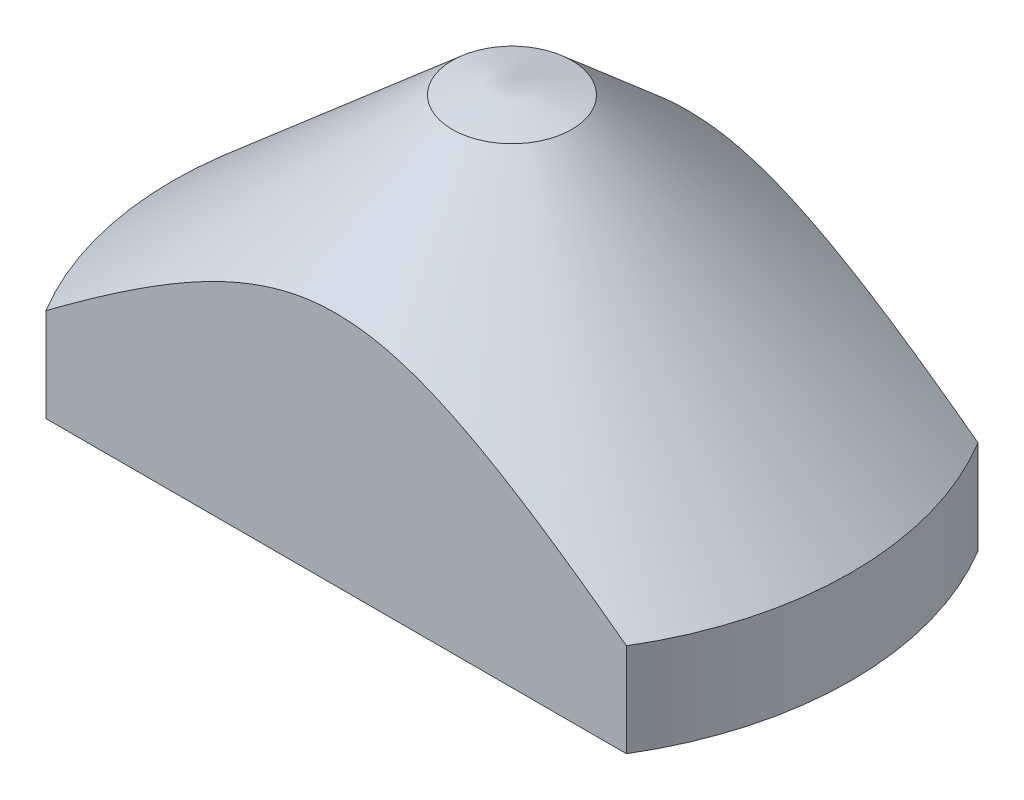
ISO-10303-21;
HEADER;
FILE_DESCRIPTION(('STEP AP214'),'2;1');
FILE_NAME('part.step','',(''),(''),'','','');
FILE_SCHEMA(('AUTOMOTIVE_DESIGN { 1 0 10303 214 1 1 1 1 }'));
ENDSEC;
DATA;
#1=APPLICATION_CONTEXT('core data for automotive mechanical design processes');
#2=APPLICATION_PROTOCOL_DEFINITION('international standard','automotive_design',2000,#1);
#3=PRODUCT_CONTEXT('',#1,'mechanical');
#4=PRODUCT('Part','Part','',(#3));
#5=PRODUCT_RELATED_PRODUCT_CATEGORY('part','',(#4));
#6=PRODUCT_DEFINITION_FORMATION('','',#4);
#7=PRODUCT_DEFINITION_CONTEXT('part definition',#1,'design');
#8=PRODUCT_DEFINITION('design','',#6,#7);
#9=PRODUCT_DEFINITION_SHAPE('','',#8);
#10=(LENGTH_UNIT() NAMED_UNIT(*) SI_UNIT(.MILLI.,.METRE.));
#11=(NAMED_UNIT(*) PLANE_ANGLE_UNIT() SI_UNIT($,.RADIAN.));
#12=(NAMED_UNIT(*) SI_UNIT($,.STERADIAN.) SOLID_ANGLE_UNIT());
#13=UNCERTAINTY_MEASURE_WITH_UNIT(LENGTH_MEASURE(1.E-05),#10,'distance_accuracy_value','');
#14=(GEOMETRIC_REPRESENTATION_CONTEXT(3) GLOBAL_UNCERTAINTY_ASSIGNED_CONTEXT((#13)) GLOBAL_UNIT_ASSIGNED_CONTEXT((#10,
#11,#12)) REPRESENTATION_CONTEXT('',''));
#15=CARTESIAN_POINT('',(0.,0.,0.));
#16=DIRECTION('',(0.,0.,1.));
#17=DIRECTION('',(1.,0.,0.));
#18=AXIS2_PLACEMENT_3D('',#15,#16,#17);
#19=CARTESIAN_POINT('',(0.,48.,0.));
#20=DIRECTION('',(0.,-1.,0.));
#21=DIRECTION('',(0.,0.,-1.));
#22=AXIS2_PLACEMENT_3D('',#19,#20,#21);
#23=CONICAL_SURFACE('',#22,8.5,0.853125178499766);
#24=CARTESIAN_POINT('',(130.802393695168,-60.8314780742673,25.));
#25=CARTESIAN_POINT('',(129.280659289647,-59.5266924388184,25.));
#26=CARTESIAN_POINT('',(127.758531853387,-58.2223651531503,25.));
#27=CARTESIAN_POINT('',(124.71338920465,-55.614733063404,25.));
#28=CARTESIAN_POINT('',(123.190373988095,-54.3114282640888,25.));
#29=CARTESIAN_POINT('',(118.613881665169,-50.398107886476,25.));
#30=CARTESIAN_POINT('',(115.558933791566,-47.7898118000967,25.));
#31=CARTESIAN_POINT('',(109.349576632576,-42.4983824116583,25.));
#32=CARTESIAN_POINT('',(106.19501348337,-39.8154295788899,25.));
#33=CARTESIAN_POINT('',(101.461230348434,-35.7995715022813,25.));
#34=CARTESIAN_POINT('',(99.8845333189138,-34.4636921002713,25.));
#35=CARTESIAN_POINT('',(96.7292952726487,-31.794271580091,25.));
#36=CARTESIAN_POINT('',(95.1507543514824,-30.4607303489665,25.));
#37=CARTESIAN_POINT('',(91.8960836495198,-27.7158272957364,25.));
#38=CARTESIAN_POINT('',(90.2198164157939,-26.3046284219135,25.));
#39=CARTESIAN_POINT('',(86.8643756827855,-23.4856876048941,25.));
#40=CARTESIAN_POINT('',(85.1852021820712,-22.0779456634016,25.));
#41=CARTESIAN_POINT('',(81.8229795155766,-19.2661804166402,25.));
#42=CARTESIAN_POINT('',(80.1399294324073,-17.862158208047,25.));
#43=CARTESIAN_POINT('',(76.7697527626938,-15.0590174648288,25.));
#44=CARTESIAN_POINT('',(75.0826261812961,-13.6598989240185,25.));
#45=CARTESIAN_POINT('',(71.6888803417423,-10.8555373311975,25.));
#46=CARTESIAN_POINT('',(69.9822185611411,-9.45034571536391,25.));
#47=CARTESIAN_POINT('',(66.5628098973319,-6.64736190927108,25.));
#48=CARTESIAN_POINT('',(64.8500629813383,-5.24956975898008,25.));
#49=CARTESIAN_POINT('',(61.4188870997408,-2.46469583555102,25.));
#50=CARTESIAN_POINT('',(59.7004660726097,-1.07760428741374,25.));
#51=CARTESIAN_POINT('',(56.2542896469761,1.68489165119693,25.));
#52=CARTESIAN_POINT('',(54.5265344158168,3.06029625006322,25.));
#53=CARTESIAN_POINT('',(51.9542690685346,5.08970535323588,25.));
#54=CARTESIAN_POINT('',(51.1143321073181,5.74950796001547,25.));
#55=CARTESIAN_POINT('',(49.4312847954013,7.06505187064022,25.));
#56=CARTESIAN_POINT('',(48.5881744517191,7.7207931834588,25.));
#57=CARTESIAN_POINT('',(46.8982848827432,9.02766501876879,25.));
#58=CARTESIAN_POINT('',(46.0515053866895,9.67879519131541,25.));
#59=CARTESIAN_POINT('',(44.3538261782609,10.9756653603516,25.));
#60=CARTESIAN_POINT('',(43.5029264658828,11.6214053568371,25.));
#61=CARTESIAN_POINT('',(41.792812963855,12.9093081692026,25.));
#62=CARTESIAN_POINT('',(40.933579264862,13.5514445693787,25.));
#63=CARTESIAN_POINT('',(39.2096011852629,14.8282869337091,25.));
#64=CARTESIAN_POINT('',(38.344856795653,15.4629928857181,25.));
#65=CARTESIAN_POINT('',(36.6091633395537,16.7234644882544,25.));
#66=CARTESIAN_POINT('',(35.7382156979612,17.3492320986083,25.));
#67=CARTESIAN_POINT('',(33.9888551310585,18.5902552505681,25.));
#68=CARTESIAN_POINT('',(33.1104422252741,19.2055108196563,25.));
#69=CARTESIAN_POINT('',(31.3602920175456,20.4126841284651,25.));
#70=CARTESIAN_POINT('',(30.4887067112072,21.0048218435013,25.));
#71=CARTESIAN_POINT('',(28.7355689280005,22.1742185920558,25.));
#72=CARTESIAN_POINT('',(27.8540162985064,22.751477397294,25.));
#73=CARTESIAN_POINT('',(26.0781662497645,23.8883351174885,25.));
#74=CARTESIAN_POINT('',(25.1838556337671,24.4479134792536,25.));
#75=CARTESIAN_POINT('',(23.3813416021952,25.5442483555153,25.));
#76=CARTESIAN_POINT('',(22.4731386884714,26.0810056917723,25.));
#77=CARTESIAN_POINT('',(20.6469381969784,27.122060677512,25.));
#78=CARTESIAN_POINT('',(19.7290590995281,27.6265651577746,25.));
#79=CARTESIAN_POINT('',(17.8741714937969,28.5998209471632,25.));
#80=CARTESIAN_POINT('',(16.9371594080412,29.068565490862,25.));
#81=CARTESIAN_POINT('',(15.0434878389258,29.9592537468159,25.));
#82=CARTESIAN_POINT('',(14.0868753443891,30.3812966994844,25.));
#83=CARTESIAN_POINT('',(12.1500960255103,31.1668584878009,25.));
#84=CARTESIAN_POINT('',(11.1699439776242,31.530412988968,25.));
#85=CARTESIAN_POINT('',(9.94458926380311,31.9337444445563,25.));
#86=CARTESIAN_POINT('',(9.71071938458372,32.0084623261258,25.));
#87=CARTESIAN_POINT('',(9.24158302584031,32.1536180824024,25.));
#88=CARTESIAN_POINT('',(9.00631620571419,32.2240548619432,25.));
#89=CARTESIAN_POINT('',(8.53435755084274,32.3604413379082,25.));
#90=CARTESIAN_POINT('',(8.29766505983997,32.4263887633444,25.));
#91=CARTESIAN_POINT('',(7.82302120255998,32.5535335916309,25.));
#92=CARTESIAN_POINT('',(7.58506991091217,32.6147312727775,25.));
#93=CARTESIAN_POINT('',(7.10807319575468,32.7321296546942,25.));
#94=CARTESIAN_POINT('',(6.86902844274142,32.7883330734463,25.));
#95=CARTESIAN_POINT('',(6.38978272677502,32.8955666965711,25.));
#96=CARTESIAN_POINT('',(6.14958175034788,32.9465968405037,25.));
#97=CARTESIAN_POINT('',(5.42739128833393,33.0916051725528,25.));
#98=CARTESIAN_POINT('',(4.94374838673838,33.177517582979,25.));
#99=CARTESIAN_POINT('',(3.98666897127328,33.3241994186456,25.));
#100=CARTESIAN_POINT('',(3.5133308452728,33.3856114467715,25.));
#101=CARTESIAN_POINT('',(2.56423960231385,33.4855811186059,25.));
#102=CARTESIAN_POINT('',(2.08848654125442,33.5241392889068,25.));
#103=CARTESIAN_POINT('',(1.13531176807347,33.5776824099422,25.));
#104=CARTESIAN_POINT('',(0.657889113654298,33.5926506664514,25.));
#105=CARTESIAN_POINT('',(-0.297107160996715,33.5986659074522,25.));
#106=CARTESIAN_POINT('',(-0.774680781053067,33.5897129196488,25.));
#107=CARTESIAN_POINT('',(-1.73310803348344,33.5478743148623,25.));
#108=CARTESIAN_POINT('',(-2.21395219258037,33.5147726508169,25.));
#109=CARTESIAN_POINT('',(-3.17342785364992,33.4250457533554,25.));
#110=CARTESIAN_POINT('',(-3.65205935486748,33.3684205119125,25.));
#111=CARTESIAN_POINT('',(-4.60598472863177,33.2327227650587,25.));
#112=CARTESIAN_POINT('',(-5.08127944176322,33.1536561372999,25.));
#113=CARTESIAN_POINT('',(-6.02785990681186,32.9744331346898,25.));
#114=CARTESIAN_POINT('',(-6.49914562155246,32.8742765644869,25.));
#115=CARTESIAN_POINT('',(-7.4428369918218,32.6530943773904,25.));
#116=CARTESIAN_POINT('',(-7.91518627301193,32.5318292582273,25.));
#117=CARTESIAN_POINT('',(-8.85478767711132,32.2710049145639,25.));
#118=CARTESIAN_POINT('',(-9.32203976332258,32.1314455584455,25.));
#119=CARTESIAN_POINT('',(-10.2512467008444,31.8357558885278,25.));
#120=CARTESIAN_POINT('',(-10.7132016214739,31.6796257918489,25.));
#121=CARTESIAN_POINT('',(-11.631761690925,31.3524573037518,25.));
#122=CARTESIAN_POINT('',(-12.0883669806044,31.18141930587,25.));
#123=CARTESIAN_POINT('',(-13.3565772922238,30.6849815427685,25.));
#124=CARTESIAN_POINT('',(-14.1624064029701,30.3447790317837,25.));
#125=CARTESIAN_POINT('',(-15.7584510552981,29.6293405451154,25.));
#126=CARTESIAN_POINT('',(-16.548662260404,29.2540950004499,25.));
#127=CARTESIAN_POINT('',(-18.1156717302813,28.4747226738099,25.));
#128=CARTESIAN_POINT('',(-18.8924551901079,28.0705662597317,25.));
#129=CARTESIAN_POINT('',(-20.4333285568865,27.2389990313797,25.));
#130=CARTESIAN_POINT('',(-21.1974195256321,26.8115901752139,25.));
#131=CARTESIAN_POINT('',(-22.7174524940606,25.9359763730643,25.));
#132=CARTESIAN_POINT('',(-23.4733521014959,25.487698081064,25.));
#133=CARTESIAN_POINT('',(-24.9754617510028,24.5752071185761,25.));
#134=CARTESIAN_POINT('',(-25.7216716293565,24.1109941793376,25.));
#135=CARTESIAN_POINT('',(-27.2052614146596,23.1695478311066,25.));
#136=CARTESIAN_POINT('',(-27.9426457726717,22.6923214210774,25.));
#137=CARTESIAN_POINT('',(-29.4100714295861,21.7267403159826,25.));
#138=CARTESIAN_POINT('',(-30.1401127808126,21.2383857002947,25.));
#139=CARTESIAN_POINT('',(-31.6043472726171,20.2450972248594,25.));
#140=CARTESIAN_POINT('',(-32.3384468285677,19.7400256010026,25.));
#141=CARTESIAN_POINT('',(-33.8008953414286,18.7216325978598,25.));
#142=CARTESIAN_POINT('',(-34.5292442916375,18.2083112089621,25.));
#143=CARTESIAN_POINT('',(-35.9809721390196,17.1745498544624,25.));
#144=CARTESIAN_POINT('',(-36.7043505573261,16.6541092170383,25.));
#145=CARTESIAN_POINT('',(-38.1466783457339,15.6071251861495,25.));
#146=CARTESIAN_POINT('',(-38.8656276974465,15.0805817673732,25.));
#147=CARTESIAN_POINT('',(-40.2978351927086,14.0235107971159,25.));
#148=CARTESIAN_POINT('',(-41.0111030308727,13.4929963717056,25.));
#149=CARTESIAN_POINT('',(-42.4341880176938,12.4273623717724,25.));
#150=CARTESIAN_POINT('',(-43.1440051672265,11.8922427984181,25.));
#151=CARTESIAN_POINT('',(-44.5605405278599,10.8179803834008,25.));
#152=CARTESIAN_POINT('',(-45.2672588665411,10.2788377098883,25.));
#153=CARTESIAN_POINT('',(-46.6779546015786,9.19697959470088,25.));
#154=CARTESIAN_POINT('',(-47.3819319970823,8.65426415191481,25.));
#155=CARTESIAN_POINT('',(-49.0003229372636,7.40077760847231,25.));
#156=CARTESIAN_POINT('',(-49.9138807552096,6.68890170177854,25.));
#157=CARTESIAN_POINT('',(-51.7373678987467,5.26051604110707,25.));
#158=CARTESIAN_POINT('',(-52.6472972138454,4.54400627374556,25.));
#159=CARTESIAN_POINT('',(-55.3723540352935,2.38846157644234,25.));
#160=CARTESIAN_POINT('',(-57.1827343414347,0.943423739157828,25.));
#161=CARTESIAN_POINT('',(-60.7937562984219,-1.95895720196784,25.));
#162=CARTESIAN_POINT('',(-62.5943973879373,-3.41630100293557,25.));
#163=CARTESIAN_POINT('',(-66.1878618909792,-6.34057070421115,25.));
#164=CARTESIAN_POINT('',(-67.980685344468,-7.80749655544121,25.));
#165=CARTESIAN_POINT('',(-71.5621439896917,-10.7507171945538,25.));
#166=CARTESIAN_POINT('',(-73.3507718062916,-12.2270209506392,25.));
#167=CARTESIAN_POINT('',(-76.9228848284013,-15.1858381313815,25.));
#168=CARTESIAN_POINT('',(-78.7063700283911,-16.6683515626996,25.));
#169=CARTESIAN_POINT('',(-82.2690363003365,-19.638429955258,25.));
#170=CARTESIAN_POINT('',(-84.0482175008165,-21.1259947623861,25.));
#171=CARTESIAN_POINT('',(-87.6030237868425,-24.1053644075509,25.));
#172=CARTESIAN_POINT('',(-89.3786488738602,-25.5971692438322,25.));
#173=CARTESIAN_POINT('',(-94.4741227816312,-29.8868593773345,25.));
#174=CARTESIAN_POINT('',(-97.7902349822544,-32.6891831243756,25.));
#175=CARTESIAN_POINT('',(-104.414724930364,-38.3030113631827,25.));
#176=CARTESIAN_POINT('',(-107.723102606927,-41.1145159385721,25.));
#177=CARTESIAN_POINT('',(-114.329271228769,-46.7405533813673,25.));
#178=CARTESIAN_POINT('',(-117.627070516235,-49.555076455453,25.));
#179=CARTESIAN_POINT('',(-122.570270507038,-53.7809115070905,25.));
#180=CARTESIAN_POINT('',(-124.21741070298,-55.1901897062918,25.));
#181=CARTESIAN_POINT('',(-127.510651595871,-58.0099593899194,25.));
#182=CARTESIAN_POINT('',(-129.156752293068,-59.4204508740572,25.));
#183=CARTESIAN_POINT('',(-130.802393695168,-60.8314780742673,25.));
#184=B_SPLINE_CURVE_WITH_KNOTS('',3,(#24,#25,#26,#27,#28,#29,#30,#31,#32,#33,#34,#35,#36,#37,
#38,#39,#40,#41,#42,#43,#44,#45,#46,#47,#48,#49,#50,#51,#52,#53,#54,#55,#56,#57,#58,#59,#60,#61,
#62,#63,#64,#65,#66,#67,#68,#69,#70,#71,#72,#73,#74,#75,#76,#77,#78,#79,#80,#81,#82,#83,#84,#85,
#86,#87,#88,#89,#90,#91,#92,#93,#94,#95,#96,#97,#98,#99,#100,#101,#102,#103,#104,#105,#106,#107,
#108,#109,#110,#111,#112,#113,#114,#115,#116,#117,#118,#119,#120,#121,#122,#123,#124,#125,#126,
#127,#128,#129,#130,#131,#132,#133,#134,#135,#136,#137,#138,#139,#140,#141,#142,#143,#144,#145,
#146,#147,#148,#149,#150,#151,#152,#153,#154,#155,#156,#157,#158,#159,#160,#161,#162,#163,#164,
#165,#166,#167,#168,#169,#170,#171,#172,#173,#174,#175,#176,#177,#178,#179,#180,#181,#182,#183),
.UNSPECIFIED.,.F.,.F.,(4,2,2,2,2,2,2,2,2,2,2,2,2,2,2,2,2,2,2,2,2,2,2,2,2,2,2,2,2,2,2,2,2,2,2,2,
2,2,2,2,2,2,2,2,2,2,2,2,2,2,2,2,2,2,2,2,2,2,2,2,2,2,2,2,2,2,2,2,2,2,2,2,2,2,2,2,2,2,2,4),(0.,
6.01359036937142,12.0272085872543,24.0780635781604,36.5016402385207,42.7012292856378,
48.9005100970768,55.4741038631351,62.0477008687948,68.6230580869044,75.1984070080259,
81.8305335351648,88.4626958492933,95.0878344406793,101.712854648612,104.9171390831,
108.121416435189,111.325934412213,114.530452391619,117.748429592804,120.966412053121,
124.18367775732,127.400935049164,130.561916448927,133.722946317301,136.887524877696,
140.051989388354,143.193548536415,146.335700570057,149.471041862855,152.604463957444,
153.340983781947,154.077691232422,154.814768626721,155.551802801629,156.288433378594,
157.02507256073,158.498147475863,159.929544336567,161.36090821413,162.793284592132,
164.225659311187,165.671008472984,167.116358127969,168.561329578362,170.006314413809,
171.468912945208,172.931521999861,174.394111892848,175.8566631883,178.479631079709,
181.103317314587,183.729732321558,186.355926497211,188.992173992366,191.628465971875,
194.263367015573,196.898249270355,199.571382858707,202.24451956169,204.917910284963,
207.5913121002,210.25808105452,212.924849332071,215.591506766077,218.258165029515,
221.732653184228,225.207151378656,232.156208835317,239.10566262941,246.055080857328,
253.012647032205,259.970220672492,266.927583918107,273.884944283775,286.909762821371,
299.934700328124,312.941351400692,319.444598066518,325.947843185839),.UNSPECIFIED.);
#185=CARTESIAN_POINT('',(41.2681778129348,13.3,25.));
#186=VERTEX_POINT('',#185);
#187=CARTESIAN_POINT('',(-41.2681778129348,13.3,25.));
#188=VERTEX_POINT('',#187);
#189=EDGE_CURVE('E114',#186,#188,#184,.T.);
#190=ORIENTED_EDGE('',*,*,#189,.F.);
#191=CARTESIAN_POINT('',(0.,13.3,0.));
#192=DIRECTION('',(0.,1.,0.));
#193=DIRECTION('',(0.,0.,1.));
#194=AXIS2_PLACEMENT_3D('',#191,#192,#193);
#195=CIRCLE('',#194,48.25);
#196=CARTESIAN_POINT('',(41.2681778129348,13.3,-25.));
#197=VERTEX_POINT('',#196);
#198=EDGE_CURVE('E52',#186,#197,#195,.T.);
#199=ORIENTED_EDGE('',*,*,#198,.T.);
#200=CARTESIAN_POINT('',(130.802393695168,-60.8314780742673,-25.));
#201=CARTESIAN_POINT('',(129.280659289647,-59.5266924388184,-25.));
#202=CARTESIAN_POINT('',(127.758531853387,-58.2223651531503,-25.));
#203=CARTESIAN_POINT('',(124.71338920465,-55.614733063404,-25.));
#204=CARTESIAN_POINT('',(123.190373988095,-54.3114282640888,-25.));
#205=CARTESIAN_POINT('',(118.613881665169,-50.398107886476,-25.));
#206=CARTESIAN_POINT('',(115.558933791566,-47.7898118000967,-25.));
#207=CARTESIAN_POINT('',(109.349576632576,-42.4983824116582,-25.));
#208=CARTESIAN_POINT('',(106.19501348337,-39.8154295788898,-25.));
#209=CARTESIAN_POINT('',(101.461230348434,-35.7995715022812,-25.));
#210=CARTESIAN_POINT('',(99.8845333189137,-34.4636921002712,-25.));
#211=CARTESIAN_POINT('',(96.7292952726485,-31.7942715800909,-25.));
#212=CARTESIAN_POINT('',(95.1507543514822,-30.4607303489664,-25.));
#213=CARTESIAN_POINT('',(91.8960836495197,-27.7158272957363,-25.));
#214=CARTESIAN_POINT('',(90.2198164157938,-26.3046284219134,-25.));
#215=CARTESIAN_POINT('',(86.8643756827854,-23.485687604894,-25.));
#216=CARTESIAN_POINT('',(85.1852021820711,-22.0779456634015,-25.));
#217=CARTESIAN_POINT('',(81.8229795155765,-19.2661804166402,-25.));
#218=CARTESIAN_POINT('',(80.1399294324072,-17.8621582080469,-25.));
#219=CARTESIAN_POINT('',(76.7697527626937,-15.0590174648287,-25.));
#220=CARTESIAN_POINT('',(75.082626181296,-13.6598989240184,-25.));
#221=CARTESIAN_POINT('',(71.6888803417422,-10.8555373311974,-25.));
#222=CARTESIAN_POINT('',(69.982218561141,-9.45034571536383,-25.));
#223=CARTESIAN_POINT('',(66.5628098973318,-6.647361909271,-25.));
#224=CARTESIAN_POINT('',(64.8500629813382,-5.24956975898001,-25.));
#225=CARTESIAN_POINT('',(61.4188870997408,-2.46469583555095,-25.));
#226=CARTESIAN_POINT('',(59.7004660726096,-1.07760428741367,-25.));
#227=CARTESIAN_POINT('',(56.2542896469761,1.684891651197,-25.));
#228=CARTESIAN_POINT('',(54.5265344158167,3.06029625006329,-25.));
#229=CARTESIAN_POINT('',(51.9542690685345,5.08970535323593,-25.));
#230=CARTESIAN_POINT('',(51.114332107318,5.74950796001552,-25.));
#231=CARTESIAN_POINT('',(49.4312847954012,7.06505187064026,-25.));
#232=CARTESIAN_POINT('',(48.588174451719,7.72079318345885,-25.));
#233=CARTESIAN_POINT('',(46.8982848827431,9.02766501876883,-25.));
#234=CARTESIAN_POINT('',(46.0515053866895,9.67879519131544,-25.));
#235=CARTESIAN_POINT('',(44.3538261782608,10.9756653603516,-25.));
#236=CARTESIAN_POINT('',(43.5029264658828,11.6214053568371,-25.));
#237=CARTESIAN_POINT('',(41.792812963855,12.9093081692026,-25.));
#238=CARTESIAN_POINT('',(40.9335792648619,13.5514445693788,-25.));
#239=CARTESIAN_POINT('',(39.2096011852628,14.8282869337091,-25.));
#240=CARTESIAN_POINT('',(38.344856795653,15.4629928857181,-25.));
#241=CARTESIAN_POINT('',(36.6091633395537,16.7234644882544,-25.));
#242=CARTESIAN_POINT('',(35.7382156979612,17.3492320986083,-25.));
#243=CARTESIAN_POINT('',(33.9888551310585,18.5902552505681,-25.));
#244=CARTESIAN_POINT('',(33.1104422252741,19.2055108196563,-25.));
#245=CARTESIAN_POINT('',(31.3602920175455,20.4126841284651,-25.));
#246=CARTESIAN_POINT('',(30.4887067112072,21.0048218435013,-25.));
#247=CARTESIAN_POINT('',(28.7355689280004,22.1742185920558,-25.));
#248=CARTESIAN_POINT('',(27.8540162985064,22.751477397294,-25.));
#249=CARTESIAN_POINT('',(26.0781662497645,23.8883351174885,-25.));
#250=CARTESIAN_POINT('',(25.1838556337671,24.4479134792536,-25.));
#251=CARTESIAN_POINT('',(23.3813416021952,25.5442483555153,-25.));
#252=CARTESIAN_POINT('',(22.4731386884714,26.0810056917724,-25.));
#253=CARTESIAN_POINT('',(20.6469381969784,27.122060677512,-25.));
#254=CARTESIAN_POINT('',(19.7290590995281,27.6265651577746,-25.));
#255=CARTESIAN_POINT('',(17.8741714937969,28.5998209471632,-25.));
#256=CARTESIAN_POINT('',(16.9371594080412,29.068565490862,-25.));
#257=CARTESIAN_POINT('',(15.0434878389258,29.9592537468158,-25.));
#258=CARTESIAN_POINT('',(14.0868753443891,30.3812966994844,-25.));
#259=CARTESIAN_POINT('',(12.1500960255104,31.1668584878009,-25.));
#260=CARTESIAN_POINT('',(11.1699439776242,31.530412988968,-25.));
#261=CARTESIAN_POINT('',(9.94458926380311,31.9337444445563,-25.));
#262=CARTESIAN_POINT('',(9.71071938458372,32.0084623261258,-25.));
#263=CARTESIAN_POINT('',(9.24158302584029,32.1536180824024,-25.));
#264=CARTESIAN_POINT('',(9.00631620571417,32.2240548619432,-25.));
#265=CARTESIAN_POINT('',(8.53435755084273,32.3604413379082,-25.));
#266=CARTESIAN_POINT('',(8.29766505983997,32.4263887633444,-25.));
#267=CARTESIAN_POINT('',(7.82302120255997,32.5535335916309,-25.));
#268=CARTESIAN_POINT('',(7.58506991091216,32.6147312727775,-25.));
#269=CARTESIAN_POINT('',(7.10807319575466,32.7321296546942,-25.));
#270=CARTESIAN_POINT('',(6.8690284427414,32.7883330734463,-25.));
#271=CARTESIAN_POINT('',(6.389782726775,32.8955666965711,-25.));
#272=CARTESIAN_POINT('',(6.14958175034787,32.9465968405037,-25.));
#273=CARTESIAN_POINT('',(5.42739128833392,33.0916051725528,-25.));
#274=CARTESIAN_POINT('',(4.94374838673838,33.177517582979,-25.));
#275=CARTESIAN_POINT('',(3.98666897127328,33.3241994186456,-25.));
#276=CARTESIAN_POINT('',(3.51333084527281,33.3856114467715,-25.));
#277=CARTESIAN_POINT('',(2.56423960231386,33.4855811186059,-25.));
#278=CARTESIAN_POINT('',(2.08848654125443,33.5241392889068,-25.));
#279=CARTESIAN_POINT('',(1.13531176807349,33.5776824099422,-25.));
#280=CARTESIAN_POINT('',(0.657889113654324,33.5926506664514,-25.));
#281=CARTESIAN_POINT('',(-0.297107160996688,33.5986659074522,-25.));
#282=CARTESIAN_POINT('',(-0.774680781053049,33.5897129196488,-25.));
#283=CARTESIAN_POINT('',(-1.73310803348343,33.5478743148623,-25.));
#284=CARTESIAN_POINT('',(-2.21395219258037,33.5147726508169,-25.));
#285=CARTESIAN_POINT('',(-3.17342785364994,33.4250457533554,-25.));
#286=CARTESIAN_POINT('',(-3.65205935486749,33.3684205119124,-25.));
#287=CARTESIAN_POINT('',(-4.60598472863178,33.2327227650587,-25.));
#288=CARTESIAN_POINT('',(-5.08127944176323,33.1536561372999,-25.));
#289=CARTESIAN_POINT('',(-6.02785990681185,32.9744331346898,-25.));
#290=CARTESIAN_POINT('',(-6.49914562155246,32.8742765644869,-25.));
#291=CARTESIAN_POINT('',(-7.44283699182178,32.6530943773904,-25.));
#292=CARTESIAN_POINT('',(-7.9151862730119,32.5318292582273,-25.));
#293=CARTESIAN_POINT('',(-8.85478767711129,32.2710049145639,-25.));
#294=CARTESIAN_POINT('',(-9.32203976332255,32.1314455584455,-25.));
#295=CARTESIAN_POINT('',(-10.2512467008444,31.8357558885278,-25.));
#296=CARTESIAN_POINT('',(-10.7132016214739,31.6796257918489,-25.));
#297=CARTESIAN_POINT('',(-11.6317616909249,31.3524573037518,-25.));
#298=CARTESIAN_POINT('',(-12.0883669806044,31.18141930587,-25.));
#299=CARTESIAN_POINT('',(-13.3565772922238,30.6849815427685,-25.));
#300=CARTESIAN_POINT('',(-14.1624064029701,30.3447790317837,-25.));
#301=CARTESIAN_POINT('',(-15.758451055298,29.6293405451154,-25.));
#302=CARTESIAN_POINT('',(-16.548662260404,29.2540950004499,-25.));
#303=CARTESIAN_POINT('',(-18.1156717302813,28.4747226738099,-25.));
#304=CARTESIAN_POINT('',(-18.8924551901079,28.0705662597317,-25.));
#305=CARTESIAN_POINT('',(-20.4333285568864,27.2389990313797,-25.));
#306=CARTESIAN_POINT('',(-21.197419525632,26.8115901752139,-25.));
#307=CARTESIAN_POINT('',(-22.7174524940606,25.9359763730643,-25.));
#308=CARTESIAN_POINT('',(-23.4733521014958,25.487698081064,-25.));
#309=CARTESIAN_POINT('',(-24.9754617510028,24.5752071185761,-25.));
#310=CARTESIAN_POINT('',(-25.7216716293564,24.1109941793376,-25.));
#311=CARTESIAN_POINT('',(-27.2052614146596,23.1695478311066,-25.));
#312=CARTESIAN_POINT('',(-27.9426457726717,22.6923214210774,-25.));
#313=CARTESIAN_POINT('',(-29.410071429586,21.7267403159826,-25.));
#314=CARTESIAN_POINT('',(-30.1401127808126,21.2383857002947,-25.));
#315=CARTESIAN_POINT('',(-31.604347272617,20.2450972248594,-25.));
#316=CARTESIAN_POINT('',(-32.3384468285677,19.7400256010026,-25.));
#317=CARTESIAN_POINT('',(-33.8008953414286,18.7216325978598,-25.));
#318=CARTESIAN_POINT('',(-34.5292442916375,18.2083112089621,-25.));
#319=CARTESIAN_POINT('',(-35.9809721390195,17.1745498544624,-25.));
#320=CARTESIAN_POINT('',(-36.7043505573261,16.6541092170383,-25.));
#321=CARTESIAN_POINT('',(-38.1466783457339,15.6071251861495,-25.));
#322=CARTESIAN_POINT('',(-38.8656276974464,15.0805817673732,-25.));
#323=CARTESIAN_POINT('',(-40.2978351927085,14.023510797116,-25.));
#324=CARTESIAN_POINT('',(-41.0111030308727,13.4929963717057,-25.));
#325=CARTESIAN_POINT('',(-42.4341880176938,12.4273623717724,-25.));
#326=CARTESIAN_POINT('',(-43.1440051672264,11.8922427984182,-25.));
#327=CARTESIAN_POINT('',(-44.5605405278599,10.8179803834008,-25.));
#328=CARTESIAN_POINT('',(-45.267258866541,10.2788377098883,-25.));
#329=CARTESIAN_POINT('',(-46.6779546015785,9.19697959470092,-25.));
#330=CARTESIAN_POINT('',(-47.3819319970822,8.65426415191484,-25.));
#331=CARTESIAN_POINT('',(-49.0003229372636,7.40077760847234,-25.));
#332=CARTESIAN_POINT('',(-49.9138807552096,6.68890170177858,-25.));
#333=CARTESIAN_POINT('',(-51.7373678987467,5.26051604110711,-25.));
#334=CARTESIAN_POINT('',(-52.6472972138454,4.54400627374561,-25.));
#335=CARTESIAN_POINT('',(-55.3723540352934,2.38846157644238,-25.));
#336=CARTESIAN_POINT('',(-57.1827343414347,0.943423739157868,-25.));
#337=CARTESIAN_POINT('',(-60.7937562984218,-1.9589572019678,-25.));
#338=CARTESIAN_POINT('',(-62.5943973879373,-3.41630100293553,-25.));
#339=CARTESIAN_POINT('',(-66.1878618909791,-6.34057070421111,-25.));
#340=CARTESIAN_POINT('',(-67.9806853444679,-7.80749655544117,-25.));
#341=CARTESIAN_POINT('',(-71.5621439896917,-10.7507171945537,-25.));
#342=CARTESIAN_POINT('',(-73.3507718062915,-12.2270209506392,-25.));
#343=CARTESIAN_POINT('',(-76.9228848284012,-15.1858381313815,-25.));
#344=CARTESIAN_POINT('',(-78.706370028391,-16.6683515626996,-25.));
#345=CARTESIAN_POINT('',(-82.2690363003364,-19.638429955258,-25.));
#346=CARTESIAN_POINT('',(-84.0482175008164,-21.1259947623861,-25.));
#347=CARTESIAN_POINT('',(-87.6030237868424,-24.1053644075508,-25.));
#348=CARTESIAN_POINT('',(-89.3786488738601,-25.5971692438321,-25.));
#349=CARTESIAN_POINT('',(-94.4741227816311,-29.8868593773344,-25.));
#350=CARTESIAN_POINT('',(-97.7902349822543,-32.6891831243756,-25.));
#351=CARTESIAN_POINT('',(-104.414724930364,-38.3030113631826,-25.));
#352=CARTESIAN_POINT('',(-107.723102606927,-41.114515938572,-25.));
#353=CARTESIAN_POINT('',(-114.329271228769,-46.7405533813672,-25.));
#354=CARTESIAN_POINT('',(-117.627070516235,-49.555076455453,-25.));
#355=CARTESIAN_POINT('',(-122.570270507038,-53.7809115070904,-25.));
#356=CARTESIAN_POINT('',(-124.21741070298,-55.1901897062917,-25.));
#357=CARTESIAN_POINT('',(-127.510651595871,-58.0099593899194,-25.));
#358=CARTESIAN_POINT('',(-129.156752293068,-59.4204508740571,-25.));
#359=CARTESIAN_POINT('',(-130.802393695168,-60.8314780742673,-25.));
#360=B_SPLINE_CURVE_WITH_KNOTS('',3,(#200,#201,#202,#203,#204,#205,#206,#207,#208,#209,#210,
#211,#212,#213,#214,#215,#216,#217,#218,#219,#220,#221,#222,#223,#224,#225,#226,#227,#228,#229,
#230,#231,#232,#233,#234,#235,#236,#237,#238,#239,#240,#241,#242,#243,#244,#245,#246,#247,#248,
#249,#250,#251,#252,#253,#254,#255,#256,#257,#258,#259,#260,#261,#262,#263,#264,#265,#266,#267,
#268,#269,#270,#271,#272,#273,#274,#275,#276,#277,#278,#279,#280,#281,#282,#283,#284,#285,#286,
#287,#288,#289,#290,#291,#292,#293,#294,#295,#296,#297,#298,#299,#300,#301,#302,#303,#304,#305,
#306,#307,#308,#309,#310,#311,#312,#313,#314,#315,#316,#317,#318,#319,#320,#321,#322,#323,#324,
#325,#326,#327,#328,#329,#330,#331,#332,#333,#334,#335,#336,#337,#338,#339,#340,#341,#342,#343,
#344,#345,#346,#347,#348,#349,#350,#351,#352,#353,#354,#355,#356,#357,#358,#359),.UNSPECIFIED.,
.F.,.F.,(4,2,2,2,2,2,2,2,2,2,2,2,2,2,2,2,2,2,2,2,2,2,2,2,2,2,2,2,2,2,2,2,2,2,2,2,2,2,2,2,2,2,2,
2,2,2,2,2,2,2,2,2,2,2,2,2,2,2,2,2,2,2,2,2,2,2,2,2,2,2,2,2,2,2,2,2,2,2,2,4),(0.,6.01359036937145,
12.0272085872544,24.0780635781605,36.5016402385208,42.7012292856379,48.900510097077,
55.4741038631353,62.047700868795,68.6230580869045,75.198407008026,81.8305335351649,
88.4626958492934,95.0878344406794,101.712854648613,104.9171390831,108.12141643519,
111.325934412213,114.530452391619,117.748429592804,120.966412053121,124.18367775732,
127.400935049164,130.561916448927,133.722946317301,136.887524877696,140.051989388354,
143.193548536415,146.335700570057,149.471041862855,152.604463957444,153.340983781947,
154.077691232422,154.814768626721,155.551802801629,156.288433378594,157.02507256073,
158.498147475863,159.929544336567,161.360908214129,162.793284592132,164.225659311187,
165.671008472984,167.116358127969,168.561329578362,170.006314413809,171.468912945208,
172.931521999861,174.394111892848,175.8566631883,178.479631079709,181.103317314587,
183.729732321558,186.355926497211,188.992173992366,191.628465971875,194.263367015573,
196.898249270355,199.571382858706,202.24451956169,204.917910284962,207.5913121002,
210.25808105452,212.92484933207,215.591506766077,218.258165029515,221.732653184228,
225.207151378655,232.156208835317,239.105662629409,246.055080857328,253.012647032205,
259.970220672492,266.927583918107,273.884944283774,286.90976282137,299.934700328124,
312.941351400692,319.444598066518,325.947843185839),.UNSPECIFIED.);
#361=CARTESIAN_POINT('',(-41.2681778129348,13.3,-25.));
#362=VERTEX_POINT('',#361);
#363=EDGE_CURVE('E103',#197,#362,#360,.T.);
#364=ORIENTED_EDGE('',*,*,#363,.T.);
#365=EDGE_CURVE('E108',#362,#188,#195,.T.);
#366=ORIENTED_EDGE('',*,*,#365,.T.);
#367=EDGE_LOOP('',(#190,#199,#364,#366));
#368=FACE_BOUND('',#367,.T.);
#369=CARTESIAN_POINT('',(0.,48.,0.));
#370=DIRECTION('',(0.,1.,0.));
#371=DIRECTION('',(0.,0.,1.));
#372=AXIS2_PLACEMENT_3D('',#369,#370,#371);
#373=CIRCLE('',#372,8.5);
#374=CARTESIAN_POINT('',(0.,48.,8.5));
#375=VERTEX_POINT('',#374);
#376=EDGE_CURVE('E11',#375,#375,#373,.T.);
#377=ORIENTED_EDGE('',*,*,#376,.F.);
#378=EDGE_LOOP('',(#377));
#379=FACE_BOUND('',#378,.T.);
#380=ADVANCED_FACE('F43',(#368,#379),#23,.T.);
#381=CARTESIAN_POINT('',(0.,53.5033500837521,0.));
#382=DIRECTION('',(0.,1.,0.));
#383=DIRECTION('',(0.,0.,1.));
#384=AXIS2_PLACEMENT_3D('',#381,#382,#383);
#385=CYLINDRICAL_SURFACE('',#384,48.25);
#386=DIRECTION('',(0.,-1.,0.));
#387=VECTOR('',#386,1.);
#388=CARTESIAN_POINT('',(-41.2681778129348,50.,25.));
#389=LINE('',#388,#387);
#390=CARTESIAN_POINT('',(-41.2681778129348,0.,25.));
#391=VERTEX_POINT('',#390);
#392=EDGE_CURVE('E59',#188,#391,#389,.T.);
#393=ORIENTED_EDGE('',*,*,#392,.F.);
#394=ORIENTED_EDGE('',*,*,#365,.F.);
#395=DIRECTION('',(0.,-1.,0.));
#396=VECTOR('',#395,1.);
#397=CARTESIAN_POINT('',(-41.2681778129348,50.,-25.));
#398=LINE('',#397,#396);
#399=CARTESIAN_POINT('',(-41.2681778129348,0.,-25.));
#400=VERTEX_POINT('',#399);
#401=EDGE_CURVE('E135',#362,#400,#398,.T.);
#402=ORIENTED_EDGE('',*,*,#401,.T.);
#403=CARTESIAN_POINT('',(0.,0.,0.));
#404=DIRECTION('',(0.,1.,0.));
#405=DIRECTION('',(0.,0.,1.));
#406=AXIS2_PLACEMENT_3D('',#403,#404,#405);
#407=CIRCLE('',#406,48.25);
#408=EDGE_CURVE('E109',#400,#391,#407,.T.);
#409=ORIENTED_EDGE('',*,*,#408,.T.);
#410=EDGE_LOOP('',(#393,#394,#402,#409));
#411=FACE_BOUND('',#410,.T.);
#412=ADVANCED_FACE('F145',(#411),#385,.T.);
#413=DIRECTION('',(0.,-1.,0.));
#414=VECTOR('',#413,1.);
#415=CARTESIAN_POINT('',(41.2681778129348,50.,25.));
#416=LINE('',#415,#414);
#417=CARTESIAN_POINT('',(41.2681778129348,0.,25.));
#418=VERTEX_POINT('',#417);
#419=EDGE_CURVE('E88',#186,#418,#416,.T.);
#420=ORIENTED_EDGE('',*,*,#419,.T.);
#421=CARTESIAN_POINT('',(41.2681778129348,0.,-25.));
#422=VERTEX_POINT('',#421);
#423=EDGE_CURVE('E100',#418,#422,#407,.T.);
#424=ORIENTED_EDGE('',*,*,#423,.T.);
#425=DIRECTION('',(0.,-1.,0.));
#426=VECTOR('',#425,1.);
#427=CARTESIAN_POINT('',(41.2681778129348,50.,-25.));
#428=LINE('',#427,#426);
#429=EDGE_CURVE('E67',#197,#422,#428,.T.);
#430=ORIENTED_EDGE('',*,*,#429,.F.);
#431=ORIENTED_EDGE('',*,*,#198,.F.);
#432=EDGE_LOOP('',(#420,#424,#430,#431));
#433=FACE_BOUND('',#432,.T.);
#434=ADVANCED_FACE('F99',(#433),#385,.T.);
#435=CARTESIAN_POINT('',(0.,0.,0.));
#436=DIRECTION('',(0.,-1.,0.));
#437=DIRECTION('',(0.,0.,-1.));
#438=AXIS2_PLACEMENT_3D('',#435,#436,#437);
#439=PLANE('',#438);
#440=DIRECTION('',(1.,0.,0.));
#441=VECTOR('',#440,1.);
#442=CARTESIAN_POINT('',(0.,0.,25.));
#443=LINE('',#442,#441);
#444=EDGE_CURVE('E85',#391,#418,#443,.T.);
#445=ORIENTED_EDGE('',*,*,#444,.F.);
#446=ORIENTED_EDGE('',*,*,#408,.F.);
#447=DIRECTION('',(1.,0.,0.));
#448=VECTOR('',#447,1.);
#449=CARTESIAN_POINT('',(0.,0.,-25.));
#450=LINE('',#449,#448);
#451=EDGE_CURVE('E106',#400,#422,#450,.T.);
#452=ORIENTED_EDGE('',*,*,#451,.T.);
#453=ORIENTED_EDGE('',*,*,#423,.F.);
#454=EDGE_LOOP('',(#445,#446,#452,#453));
#455=FACE_BOUND('',#454,.T.);
#456=ADVANCED_FACE('F105',(#455),#439,.T.);
#457=CARTESIAN_POINT('',(0.,50.,0.));
#458=DIRECTION('',(0.,-1.,0.));
#459=DIRECTION('',(0.,0.,-1.));
#460=AXIS2_PLACEMENT_3D('',#457,#458,#459);
#461=CONICAL_SURFACE('',#460,0.,1.339705659599);
#462=ORIENTED_EDGE('',*,*,#376,.T.);
#463=EDGE_LOOP('',(#462));
#464=FACE_BOUND('',#463,.T.);
#465=CARTESIAN_POINT('',(0.,50.,0.));
#466=VERTEX_POINT('',#465);
#467=VERTEX_LOOP('',#466);
#468=FACE_BOUND('',#467,.T.);
#469=ADVANCED_FACE('F45',(#464,#468),#461,.T.);
#470=CARTESIAN_POINT('',(0.,50.,-25.));
#471=DIRECTION('',(0.,0.,-1.));
#472=DIRECTION('',(-1.,0.,0.));
#473=AXIS2_PLACEMENT_3D('',#470,#471,#472);
#474=PLANE('',#473);
#475=ORIENTED_EDGE('',*,*,#429,.T.);
#476=ORIENTED_EDGE('',*,*,#451,.F.);
#477=ORIENTED_EDGE('',*,*,#401,.F.);
#478=ORIENTED_EDGE('',*,*,#363,.F.);
#479=EDGE_LOOP('',(#475,#476,#477,#478));
#480=FACE_BOUND('',#479,.T.);
#481=ADVANCED_FACE('F139',(#480),#474,.T.);
#482=CARTESIAN_POINT('',(0.,50.,25.));
#483=DIRECTION('',(0.,0.,-1.));
#484=DIRECTION('',(-1.,0.,0.));
#485=AXIS2_PLACEMENT_3D('',#482,#483,#484);
#486=PLANE('',#485);
#487=ORIENTED_EDGE('',*,*,#189,.T.);
#488=ORIENTED_EDGE('',*,*,#392,.T.);
#489=ORIENTED_EDGE('',*,*,#444,.T.);
#490=ORIENTED_EDGE('',*,*,#419,.F.);
#491=EDGE_LOOP('',(#487,#488,#489,#490));
#492=FACE_BOUND('',#491,.T.);
#493=ADVANCED_FACE('F87',(#492),#486,.F.);
#494=CLOSED_SHELL('',(#380,#412,#434,#456,#469,#481,#493));
#495=MANIFOLD_SOLID_BREP('B2',#494);
#496=ADVANCED_BREP_SHAPE_REPRESENTATION('',(#18,#495),#14);
#497=SHAPE_DEFINITION_REPRESENTATION(#9,#496);
ENDSEC;
END-ISO-10303-21;
